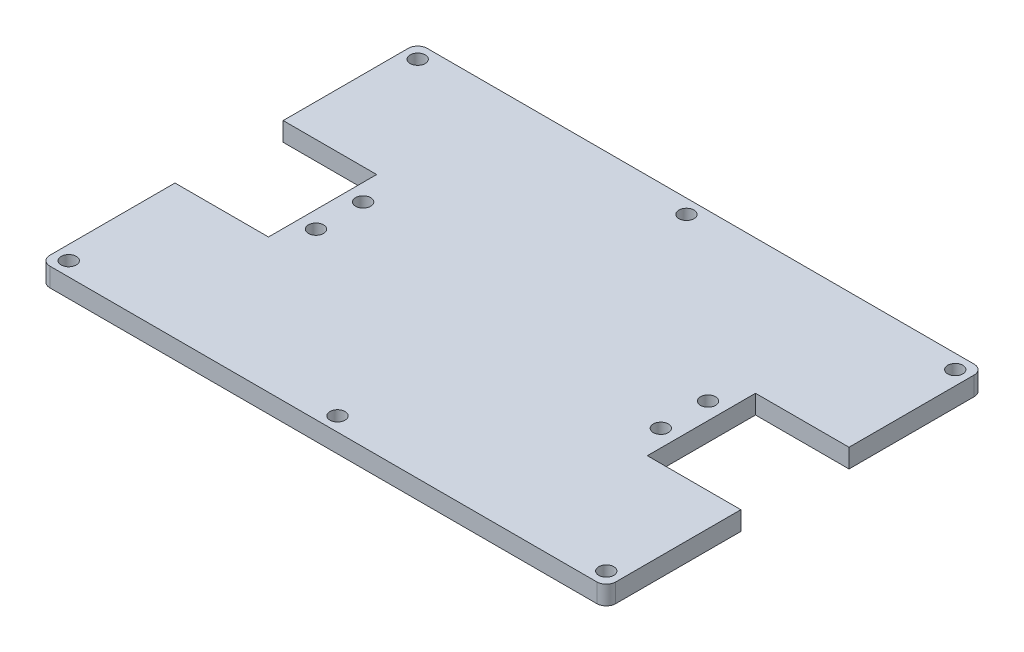
ISO-10303-21;
HEADER;
FILE_DESCRIPTION(('STEP AP214'),'2;1');
FILE_NAME('part.step','',(''),(''),'','','');
FILE_SCHEMA(('AUTOMOTIVE_DESIGN { 1 0 10303 214 1 1 1 1 }'));
ENDSEC;
DATA;
#1=APPLICATION_CONTEXT('core data for automotive mechanical design processes');
#2=APPLICATION_PROTOCOL_DEFINITION('international standard','automotive_design',2000,#1);
#3=PRODUCT_CONTEXT('',#1,'mechanical');
#4=PRODUCT('Part','Part','',(#3));
#5=PRODUCT_RELATED_PRODUCT_CATEGORY('part','',(#4));
#6=PRODUCT_DEFINITION_FORMATION('','',#4);
#7=PRODUCT_DEFINITION_CONTEXT('part definition',#1,'design');
#8=PRODUCT_DEFINITION('design','',#6,#7);
#9=PRODUCT_DEFINITION_SHAPE('','',#8);
#10=(LENGTH_UNIT() NAMED_UNIT(*) SI_UNIT(.MILLI.,.METRE.));
#11=(NAMED_UNIT(*) PLANE_ANGLE_UNIT() SI_UNIT($,.RADIAN.));
#12=(NAMED_UNIT(*) SI_UNIT($,.STERADIAN.) SOLID_ANGLE_UNIT());
#13=UNCERTAINTY_MEASURE_WITH_UNIT(LENGTH_MEASURE(1.E-05),#10,'distance_accuracy_value','');
#14=(GEOMETRIC_REPRESENTATION_CONTEXT(3) GLOBAL_UNCERTAINTY_ASSIGNED_CONTEXT((#13)) GLOBAL_UNIT_ASSIGNED_CONTEXT((#10,
#11,#12)) REPRESENTATION_CONTEXT('',''));
#15=CARTESIAN_POINT('',(0.,0.,0.));
#16=DIRECTION('',(0.,0.,1.));
#17=DIRECTION('',(1.,0.,0.));
#18=AXIS2_PLACEMENT_3D('',#15,#16,#17);
#19=CARTESIAN_POINT('',(100.17,4.,0.));
#20=DIRECTION('',(1.,0.,0.));
#21=DIRECTION('',(0.,0.,-1.));
#22=AXIS2_PLACEMENT_3D('',#19,#20,#21);
#23=PLANE('',#22);
#24=DIRECTION('',(0.,0.,1.));
#25=VECTOR('',#24,1.);
#26=CARTESIAN_POINT('',(100.17,0.,0.));
#27=LINE('',#26,#25);
#28=CARTESIAN_POINT('',(100.17,0.,-51.47));
#29=VERTEX_POINT('',#28);
#30=CARTESIAN_POINT('',(100.17,0.,-28.53));
#31=VERTEX_POINT('',#30);
#32=EDGE_CURVE('E155',#29,#31,#27,.T.);
#33=ORIENTED_EDGE('',*,*,#32,.F.);
#34=DIRECTION('',(0.,-1.,0.));
#35=VECTOR('',#34,1.);
#36=CARTESIAN_POINT('',(100.17,4.,-51.47));
#37=LINE('',#36,#35);
#38=CARTESIAN_POINT('',(100.17,4.,-51.47));
#39=VERTEX_POINT('',#38);
#40=EDGE_CURVE('E151',#39,#29,#37,.T.);
#41=ORIENTED_EDGE('',*,*,#40,.F.);
#42=DIRECTION('',(0.,0.,1.));
#43=VECTOR('',#42,1.);
#44=CARTESIAN_POINT('',(100.17,4.,0.));
#45=LINE('',#44,#43);
#46=CARTESIAN_POINT('',(100.17,4.,-28.53));
#47=VERTEX_POINT('',#46);
#48=EDGE_CURVE('E153',#39,#47,#45,.T.);
#49=ORIENTED_EDGE('',*,*,#48,.T.);
#50=DIRECTION('',(0.,-1.,0.));
#51=VECTOR('',#50,1.);
#52=CARTESIAN_POINT('',(100.17,4.,-28.53));
#53=LINE('',#52,#51);
#54=EDGE_CURVE('E211',#47,#31,#53,.T.);
#55=ORIENTED_EDGE('',*,*,#54,.T.);
#56=EDGE_LOOP('',(#33,#41,#49,#55));
#57=FACE_BOUND('',#56,.T.);
#58=ADVANCED_FACE('F39',(#57),#23,.T.);
#59=CARTESIAN_POINT('',(0.,4.,-51.47));
#60=DIRECTION('',(0.,0.,1.));
#61=DIRECTION('',(1.,0.,0.));
#62=AXIS2_PLACEMENT_3D('',#59,#60,#61);
#63=PLANE('',#62);
#64=DIRECTION('',(-1.,0.,0.));
#65=VECTOR('',#64,1.);
#66=CARTESIAN_POINT('',(0.,0.,-51.47));
#67=LINE('',#66,#65);
#68=CARTESIAN_POINT('',(120.,0.,-51.47));
#69=VERTEX_POINT('',#68);
#70=EDGE_CURVE('E254',#69,#29,#67,.T.);
#71=ORIENTED_EDGE('',*,*,#70,.F.);
#72=DIRECTION('',(0.,-1.,0.));
#73=VECTOR('',#72,1.);
#74=CARTESIAN_POINT('',(120.,4.,-51.47));
#75=LINE('',#74,#73);
#76=CARTESIAN_POINT('',(120.,4.,-51.47));
#77=VERTEX_POINT('',#76);
#78=EDGE_CURVE('E162',#77,#69,#75,.T.);
#79=ORIENTED_EDGE('',*,*,#78,.F.);
#80=DIRECTION('',(-1.,0.,0.));
#81=VECTOR('',#80,1.);
#82=CARTESIAN_POINT('',(0.,4.,-51.47));
#83=LINE('',#82,#81);
#84=EDGE_CURVE('E168',#77,#39,#83,.T.);
#85=ORIENTED_EDGE('',*,*,#84,.T.);
#86=ORIENTED_EDGE('',*,*,#40,.T.);
#87=EDGE_LOOP('',(#71,#79,#85,#86));
#88=FACE_BOUND('',#87,.T.);
#89=ADVANCED_FACE('F175',(#88),#63,.T.);
#90=CARTESIAN_POINT('',(120.,4.,0.));
#91=DIRECTION('',(-1.,0.,0.));
#92=DIRECTION('',(0.,0.,1.));
#93=AXIS2_PLACEMENT_3D('',#90,#91,#92);
#94=PLANE('',#93);
#95=DIRECTION('',(0.,0.,-1.));
#96=VECTOR('',#95,1.);
#97=CARTESIAN_POINT('',(120.,0.,0.));
#98=LINE('',#97,#96);
#99=CARTESIAN_POINT('',(120.,0.,-78.));
#100=VERTEX_POINT('',#99);
#101=EDGE_CURVE('E257',#69,#100,#98,.T.);
#102=ORIENTED_EDGE('',*,*,#101,.T.);
#103=DIRECTION('',(0.,-1.,0.));
#104=VECTOR('',#103,1.);
#105=CARTESIAN_POINT('',(120.,4.,-78.));
#106=LINE('',#105,#104);
#107=CARTESIAN_POINT('',(120.,4.,-78.));
#108=VERTEX_POINT('',#107);
#109=EDGE_CURVE('E333',#100,#108,#106,.F.);
#110=ORIENTED_EDGE('',*,*,#109,.T.);
#111=DIRECTION('',(0.,0.,-1.));
#112=VECTOR('',#111,1.);
#113=CARTESIAN_POINT('',(120.,4.,0.));
#114=LINE('',#113,#112);
#115=EDGE_CURVE('E178',#77,#108,#114,.T.);
#116=ORIENTED_EDGE('',*,*,#115,.F.);
#117=ORIENTED_EDGE('',*,*,#78,.T.);
#118=EDGE_LOOP('',(#102,#110,#116,#117));
#119=FACE_BOUND('',#118,.T.);
#120=ADVANCED_FACE('F435',(#119),#94,.F.);
#121=CARTESIAN_POINT('',(0.,4.,-80.));
#122=DIRECTION('',(0.,0.,-1.));
#123=DIRECTION('',(-1.,0.,0.));
#124=AXIS2_PLACEMENT_3D('',#121,#122,#123);
#125=PLANE('',#124);
#126=DIRECTION('',(1.,0.,0.));
#127=VECTOR('',#126,1.);
#128=CARTESIAN_POINT('',(0.,4.,-80.));
#129=LINE('',#128,#127);
#130=CARTESIAN_POINT('',(2.,4.,-80.));
#131=VERTEX_POINT('',#130);
#132=CARTESIAN_POINT('',(118.,4.,-80.));
#133=VERTEX_POINT('',#132);
#134=EDGE_CURVE('E181',#131,#133,#129,.T.);
#135=ORIENTED_EDGE('',*,*,#134,.T.);
#136=DIRECTION('',(0.,-1.,0.));
#137=VECTOR('',#136,1.);
#138=CARTESIAN_POINT('',(118.,0.,-80.));
#139=LINE('',#138,#137);
#140=CARTESIAN_POINT('',(118.,0.,-80.));
#141=VERTEX_POINT('',#140);
#142=EDGE_CURVE('E326',#133,#141,#139,.T.);
#143=ORIENTED_EDGE('',*,*,#142,.T.);
#144=DIRECTION('',(1.,0.,0.));
#145=VECTOR('',#144,1.);
#146=CARTESIAN_POINT('',(0.,0.,-80.));
#147=LINE('',#146,#145);
#148=CARTESIAN_POINT('',(2.,0.,-80.));
#149=VERTEX_POINT('',#148);
#150=EDGE_CURVE('E261',#149,#141,#147,.T.);
#151=ORIENTED_EDGE('',*,*,#150,.F.);
#152=DIRECTION('',(0.,-1.,0.));
#153=VECTOR('',#152,1.);
#154=CARTESIAN_POINT('',(2.,4.,-80.));
#155=LINE('',#154,#153);
#156=EDGE_CURVE('E320',#149,#131,#155,.F.);
#157=ORIENTED_EDGE('',*,*,#156,.T.);
#158=EDGE_LOOP('',(#135,#143,#151,#157));
#159=FACE_BOUND('',#158,.T.);
#160=ADVANCED_FACE('F507',(#159),#125,.T.);
#161=CARTESIAN_POINT('',(0.,4.,0.));
#162=DIRECTION('',(-1.,0.,0.));
#163=DIRECTION('',(0.,0.,1.));
#164=AXIS2_PLACEMENT_3D('',#161,#162,#163);
#165=PLANE('',#164);
#166=DIRECTION('',(0.,0.,-1.));
#167=VECTOR('',#166,1.);
#168=CARTESIAN_POINT('',(0.,4.,0.));
#169=LINE('',#168,#167);
#170=CARTESIAN_POINT('',(0.,4.,-51.47));
#171=VERTEX_POINT('',#170);
#172=CARTESIAN_POINT('',(0.,4.,-78.));
#173=VERTEX_POINT('',#172);
#174=EDGE_CURVE('E189',#171,#173,#169,.T.);
#175=ORIENTED_EDGE('',*,*,#174,.T.);
#176=DIRECTION('',(0.,-1.,0.));
#177=VECTOR('',#176,1.);
#178=CARTESIAN_POINT('',(0.,4.,-78.));
#179=LINE('',#178,#177);
#180=CARTESIAN_POINT('',(0.,0.,-78.));
#181=VERTEX_POINT('',#180);
#182=EDGE_CURVE('E161',#173,#181,#179,.T.);
#183=ORIENTED_EDGE('',*,*,#182,.T.);
#184=DIRECTION('',(0.,0.,-1.));
#185=VECTOR('',#184,1.);
#186=CARTESIAN_POINT('',(0.,0.,0.));
#187=LINE('',#186,#185);
#188=CARTESIAN_POINT('',(0.,0.,-51.47));
#189=VERTEX_POINT('',#188);
#190=EDGE_CURVE('E266',#189,#181,#187,.T.);
#191=ORIENTED_EDGE('',*,*,#190,.F.);
#192=DIRECTION('',(0.,-1.,0.));
#193=VECTOR('',#192,1.);
#194=CARTESIAN_POINT('',(0.,4.,-51.47));
#195=LINE('',#194,#193);
#196=EDGE_CURVE('E309',#171,#189,#195,.T.);
#197=ORIENTED_EDGE('',*,*,#196,.F.);
#198=EDGE_LOOP('',(#175,#183,#191,#197));
#199=FACE_BOUND('',#198,.T.);
#200=ADVANCED_FACE('F513',(#199),#165,.T.);
#201=CARTESIAN_POINT('',(0.,4.,-51.47));
#202=DIRECTION('',(0.,0.,-1.));
#203=DIRECTION('',(-1.,0.,0.));
#204=AXIS2_PLACEMENT_3D('',#201,#202,#203);
#205=PLANE('',#204);
#206=DIRECTION('',(1.,0.,0.));
#207=VECTOR('',#206,1.);
#208=CARTESIAN_POINT('',(0.,0.,-51.47));
#209=LINE('',#208,#207);
#210=CARTESIAN_POINT('',(19.83,0.,-51.47));
#211=VERTEX_POINT('',#210);
#212=EDGE_CURVE('E270',#189,#211,#209,.T.);
#213=ORIENTED_EDGE('',*,*,#212,.T.);
#214=DIRECTION('',(0.,-1.,0.));
#215=VECTOR('',#214,1.);
#216=CARTESIAN_POINT('',(19.83,4.,-51.47));
#217=LINE('',#216,#215);
#218=CARTESIAN_POINT('',(19.83,4.,-51.47));
#219=VERTEX_POINT('',#218);
#220=EDGE_CURVE('E305',#219,#211,#217,.T.);
#221=ORIENTED_EDGE('',*,*,#220,.F.);
#222=DIRECTION('',(1.,0.,0.));
#223=VECTOR('',#222,1.);
#224=CARTESIAN_POINT('',(0.,4.,-51.47));
#225=LINE('',#224,#223);
#226=EDGE_CURVE('E193',#171,#219,#225,.T.);
#227=ORIENTED_EDGE('',*,*,#226,.F.);
#228=ORIENTED_EDGE('',*,*,#196,.T.);
#229=EDGE_LOOP('',(#213,#221,#227,#228));
#230=FACE_BOUND('',#229,.T.);
#231=ADVANCED_FACE('F518',(#230),#205,.F.);
#232=CARTESIAN_POINT('',(19.83,4.,0.));
#233=DIRECTION('',(1.,0.,0.));
#234=DIRECTION('',(0.,0.,-1.));
#235=AXIS2_PLACEMENT_3D('',#232,#233,#234);
#236=PLANE('',#235);
#237=DIRECTION('',(0.,0.,1.));
#238=VECTOR('',#237,1.);
#239=CARTESIAN_POINT('',(19.83,0.,0.));
#240=LINE('',#239,#238);
#241=CARTESIAN_POINT('',(19.83,0.,-28.53));
#242=VERTEX_POINT('',#241);
#243=EDGE_CURVE('E275',#211,#242,#240,.T.);
#244=ORIENTED_EDGE('',*,*,#243,.T.);
#245=DIRECTION('',(0.,-1.,0.));
#246=VECTOR('',#245,1.);
#247=CARTESIAN_POINT('',(19.83,4.,-28.53));
#248=LINE('',#247,#246);
#249=CARTESIAN_POINT('',(19.83,4.,-28.53));
#250=VERTEX_POINT('',#249);
#251=EDGE_CURVE('E301',#250,#242,#248,.T.);
#252=ORIENTED_EDGE('',*,*,#251,.F.);
#253=DIRECTION('',(0.,0.,1.));
#254=VECTOR('',#253,1.);
#255=CARTESIAN_POINT('',(19.83,4.,0.));
#256=LINE('',#255,#254);
#257=EDGE_CURVE('E198',#219,#250,#256,.T.);
#258=ORIENTED_EDGE('',*,*,#257,.F.);
#259=ORIENTED_EDGE('',*,*,#220,.T.);
#260=EDGE_LOOP('',(#244,#252,#258,#259));
#261=FACE_BOUND('',#260,.T.);
#262=ADVANCED_FACE('F520',(#261),#236,.F.);
#263=CARTESIAN_POINT('',(0.,4.,-28.53));
#264=DIRECTION('',(0.,0.,1.));
#265=DIRECTION('',(1.,0.,0.));
#266=AXIS2_PLACEMENT_3D('',#263,#264,#265);
#267=PLANE('',#266);
#268=DIRECTION('',(-1.,0.,0.));
#269=VECTOR('',#268,1.);
#270=CARTESIAN_POINT('',(0.,0.,-28.53));
#271=LINE('',#270,#269);
#272=CARTESIAN_POINT('',(0.,0.,-28.53));
#273=VERTEX_POINT('',#272);
#274=EDGE_CURVE('E279',#242,#273,#271,.T.);
#275=ORIENTED_EDGE('',*,*,#274,.T.);
#276=DIRECTION('',(0.,-1.,0.));
#277=VECTOR('',#276,1.);
#278=CARTESIAN_POINT('',(0.,4.,-28.53));
#279=LINE('',#278,#277);
#280=CARTESIAN_POINT('',(0.,4.,-28.53));
#281=VERTEX_POINT('',#280);
#282=EDGE_CURVE('E297',#281,#273,#279,.T.);
#283=ORIENTED_EDGE('',*,*,#282,.F.);
#284=DIRECTION('',(-1.,0.,0.));
#285=VECTOR('',#284,1.);
#286=CARTESIAN_POINT('',(0.,4.,-28.53));
#287=LINE('',#286,#285);
#288=EDGE_CURVE('E202',#250,#281,#287,.T.);
#289=ORIENTED_EDGE('',*,*,#288,.F.);
#290=ORIENTED_EDGE('',*,*,#251,.T.);
#291=EDGE_LOOP('',(#275,#283,#289,#290));
#292=FACE_BOUND('',#291,.T.);
#293=ADVANCED_FACE('F367',(#292),#267,.F.);
#294=CARTESIAN_POINT('',(0.,0.,-2.));
#295=VERTEX_POINT('',#294);
#296=EDGE_CURVE('E271',#295,#273,#187,.T.);
#297=ORIENTED_EDGE('',*,*,#296,.F.);
#298=DIRECTION('',(0.,-1.,0.));
#299=VECTOR('',#298,1.);
#300=CARTESIAN_POINT('',(0.,4.,-2.));
#301=LINE('',#300,#299);
#302=CARTESIAN_POINT('',(0.,4.,-2.));
#303=VERTEX_POINT('',#302);
#304=EDGE_CURVE('E48',#295,#303,#301,.F.);
#305=ORIENTED_EDGE('',*,*,#304,.T.);
#306=EDGE_CURVE('E194',#303,#281,#169,.T.);
#307=ORIENTED_EDGE('',*,*,#306,.T.);
#308=ORIENTED_EDGE('',*,*,#282,.T.);
#309=EDGE_LOOP('',(#297,#305,#307,#308));
#310=FACE_BOUND('',#309,.T.);
#311=ADVANCED_FACE('F362',(#310),#165,.T.);
#312=CARTESIAN_POINT('',(0.,4.,0.));
#313=DIRECTION('',(0.,0.,-1.));
#314=DIRECTION('',(-1.,0.,0.));
#315=AXIS2_PLACEMENT_3D('',#312,#313,#314);
#316=PLANE('',#315);
#317=DIRECTION('',(1.,0.,0.));
#318=VECTOR('',#317,1.);
#319=CARTESIAN_POINT('',(0.,4.,0.));
#320=LINE('',#319,#318);
#321=CARTESIAN_POINT('',(2.,4.,0.));
#322=VERTEX_POINT('',#321);
#323=CARTESIAN_POINT('',(118.,4.,0.));
#324=VERTEX_POINT('',#323);
#325=EDGE_CURVE('E206',#322,#324,#320,.T.);
#326=ORIENTED_EDGE('',*,*,#325,.F.);
#327=DIRECTION('',(0.,-1.,0.));
#328=VECTOR('',#327,1.);
#329=CARTESIAN_POINT('',(2.,0.,0.));
#330=LINE('',#329,#328);
#331=CARTESIAN_POINT('',(2.,0.,0.));
#332=VERTEX_POINT('',#331);
#333=EDGE_CURVE('E354',#322,#332,#330,.T.);
#334=ORIENTED_EDGE('',*,*,#333,.T.);
#335=DIRECTION('',(1.,0.,0.));
#336=VECTOR('',#335,1.);
#337=CARTESIAN_POINT('',(0.,0.,0.));
#338=LINE('',#337,#336);
#339=CARTESIAN_POINT('',(118.,0.,0.));
#340=VERTEX_POINT('',#339);
#341=EDGE_CURVE('E283',#332,#340,#338,.T.);
#342=ORIENTED_EDGE('',*,*,#341,.T.);
#343=DIRECTION('',(0.,-1.,0.));
#344=VECTOR('',#343,1.);
#345=CARTESIAN_POINT('',(118.,4.,0.));
#346=LINE('',#345,#344);
#347=EDGE_CURVE('E347',#340,#324,#346,.F.);
#348=ORIENTED_EDGE('',*,*,#347,.T.);
#349=EDGE_LOOP('',(#326,#334,#342,#348));
#350=FACE_BOUND('',#349,.T.);
#351=ADVANCED_FACE('F540',(#350),#316,.F.);
#352=CARTESIAN_POINT('',(120.,4.,-2.));
#353=VERTEX_POINT('',#352);
#354=CARTESIAN_POINT('',(120.,4.,-28.53));
#355=VERTEX_POINT('',#354);
#356=EDGE_CURVE('E183',#353,#355,#114,.T.);
#357=ORIENTED_EDGE('',*,*,#356,.F.);
#358=DIRECTION('',(0.,-1.,0.));
#359=VECTOR('',#358,1.);
#360=CARTESIAN_POINT('',(120.,4.,-2.));
#361=LINE('',#360,#359);
#362=CARTESIAN_POINT('',(120.,0.,-2.));
#363=VERTEX_POINT('',#362);
#364=EDGE_CURVE('E339',#353,#363,#361,.T.);
#365=ORIENTED_EDGE('',*,*,#364,.T.);
#366=CARTESIAN_POINT('',(120.,0.,-28.53));
#367=VERTEX_POINT('',#366);
#368=EDGE_CURVE('E262',#363,#367,#98,.T.);
#369=ORIENTED_EDGE('',*,*,#368,.T.);
#370=DIRECTION('',(0.,-1.,0.));
#371=VECTOR('',#370,1.);
#372=CARTESIAN_POINT('',(120.,4.,-28.53));
#373=LINE('',#372,#371);
#374=EDGE_CURVE('E293',#355,#367,#373,.T.);
#375=ORIENTED_EDGE('',*,*,#374,.F.);
#376=EDGE_LOOP('',(#357,#365,#369,#375));
#377=FACE_BOUND('',#376,.T.);
#378=ADVANCED_FACE('F442',(#377),#94,.F.);
#379=CARTESIAN_POINT('',(3.,4.,-77.));
#380=DIRECTION('',(0.,-1.,0.));
#381=DIRECTION('',(0.,0.,-1.));
#382=AXIS2_PLACEMENT_3D('',#379,#380,#381);
#383=CYLINDRICAL_SURFACE('',#382,1.6);
#384=CARTESIAN_POINT('',(3.,4.,-77.));
#385=DIRECTION('',(0.,1.,0.));
#386=DIRECTION('',(0.,0.,1.));
#387=AXIS2_PLACEMENT_3D('',#384,#385,#386);
#388=CIRCLE('',#387,1.6);
#389=CARTESIAN_POINT('',(3.,4.,-75.4));
#390=VERTEX_POINT('',#389);
#391=EDGE_CURVE('E173',#390,#390,#388,.T.);
#392=ORIENTED_EDGE('',*,*,#391,.T.);
#393=EDGE_LOOP('',(#392));
#394=FACE_BOUND('',#393,.T.);
#395=CARTESIAN_POINT('',(3.,0.,-77.));
#396=DIRECTION('',(0.,1.,0.));
#397=DIRECTION('',(0.,0.,1.));
#398=AXIS2_PLACEMENT_3D('',#395,#396,#397);
#399=CIRCLE('',#398,1.6);
#400=CARTESIAN_POINT('',(3.,0.,-75.4));
#401=VERTEX_POINT('',#400);
#402=EDGE_CURVE('E248',#401,#401,#399,.T.);
#403=ORIENTED_EDGE('',*,*,#402,.F.);
#404=EDGE_LOOP('',(#403));
#405=FACE_BOUND('',#404,.T.);
#406=ADVANCED_FACE('F411',(#394,#405),#383,.F.);
#407=CARTESIAN_POINT('',(3.,4.,-3.));
#408=DIRECTION('',(0.,-1.,0.));
#409=DIRECTION('',(0.,0.,-1.));
#410=AXIS2_PLACEMENT_3D('',#407,#408,#409);
#411=CYLINDRICAL_SURFACE('',#410,1.6);
#412=CARTESIAN_POINT('',(3.,4.,-3.));
#413=DIRECTION('',(0.,1.,0.));
#414=DIRECTION('',(0.,0.,1.));
#415=AXIS2_PLACEMENT_3D('',#412,#413,#414);
#416=CIRCLE('',#415,1.6);
#417=CARTESIAN_POINT('',(3.,4.,-1.4));
#418=VERTEX_POINT('',#417);
#419=EDGE_CURVE('E403',#418,#418,#416,.T.);
#420=ORIENTED_EDGE('',*,*,#419,.T.);
#421=EDGE_LOOP('',(#420));
#422=FACE_BOUND('',#421,.T.);
#423=CARTESIAN_POINT('',(3.,0.,-3.));
#424=DIRECTION('',(0.,1.,0.));
#425=DIRECTION('',(0.,0.,1.));
#426=AXIS2_PLACEMENT_3D('',#423,#424,#425);
#427=CIRCLE('',#426,1.6);
#428=CARTESIAN_POINT('',(3.,0.,-1.4));
#429=VERTEX_POINT('',#428);
#430=EDGE_CURVE('E244',#429,#429,#427,.T.);
#431=ORIENTED_EDGE('',*,*,#430,.F.);
#432=EDGE_LOOP('',(#431));
#433=FACE_BOUND('',#432,.T.);
#434=ADVANCED_FACE('F441',(#422,#433),#411,.F.);
#435=CARTESIAN_POINT('',(117.,4.,-77.));
#436=DIRECTION('',(0.,-1.,0.));
#437=DIRECTION('',(0.,0.,-1.));
#438=AXIS2_PLACEMENT_3D('',#435,#436,#437);
#439=CYLINDRICAL_SURFACE('',#438,1.60000000000001);
#440=CARTESIAN_POINT('',(117.,4.,-77.));
#441=DIRECTION('',(0.,1.,0.));
#442=DIRECTION('',(0.,0.,1.));
#443=AXIS2_PLACEMENT_3D('',#440,#441,#442);
#444=CIRCLE('',#443,1.60000000000001);
#445=CARTESIAN_POINT('',(117.,4.,-75.4));
#446=VERTEX_POINT('',#445);
#447=EDGE_CURVE('E399',#446,#446,#444,.T.);
#448=ORIENTED_EDGE('',*,*,#447,.T.);
#449=EDGE_LOOP('',(#448));
#450=FACE_BOUND('',#449,.T.);
#451=CARTESIAN_POINT('',(117.,0.,-77.));
#452=DIRECTION('',(0.,1.,0.));
#453=DIRECTION('',(0.,0.,1.));
#454=AXIS2_PLACEMENT_3D('',#451,#452,#453);
#455=CIRCLE('',#454,1.60000000000001);
#456=CARTESIAN_POINT('',(117.,0.,-75.4));
#457=VERTEX_POINT('',#456);
#458=EDGE_CURVE('E240',#457,#457,#455,.T.);
#459=ORIENTED_EDGE('',*,*,#458,.F.);
#460=EDGE_LOOP('',(#459));
#461=FACE_BOUND('',#460,.T.);
#462=ADVANCED_FACE('F445',(#450,#461),#439,.F.);
#463=CARTESIAN_POINT('',(117.,4.,-3.));
#464=DIRECTION('',(0.,-1.,0.));
#465=DIRECTION('',(0.,0.,-1.));
#466=AXIS2_PLACEMENT_3D('',#463,#464,#465);
#467=CYLINDRICAL_SURFACE('',#466,1.60000000000001);
#468=CARTESIAN_POINT('',(117.,4.,-3.));
#469=DIRECTION('',(0.,1.,0.));
#470=DIRECTION('',(0.,0.,1.));
#471=AXIS2_PLACEMENT_3D('',#468,#469,#470);
#472=CIRCLE('',#471,1.60000000000001);
#473=CARTESIAN_POINT('',(117.,4.,-1.39999999999999));
#474=VERTEX_POINT('',#473);
#475=EDGE_CURVE('E395',#474,#474,#472,.T.);
#476=ORIENTED_EDGE('',*,*,#475,.T.);
#477=EDGE_LOOP('',(#476));
#478=FACE_BOUND('',#477,.T.);
#479=CARTESIAN_POINT('',(117.,0.,-3.));
#480=DIRECTION('',(0.,1.,0.));
#481=DIRECTION('',(0.,0.,1.));
#482=AXIS2_PLACEMENT_3D('',#479,#480,#481);
#483=CIRCLE('',#482,1.60000000000001);
#484=CARTESIAN_POINT('',(117.,0.,-1.39999999999999));
#485=VERTEX_POINT('',#484);
#486=EDGE_CURVE('E236',#485,#485,#483,.T.);
#487=ORIENTED_EDGE('',*,*,#486,.F.);
#488=EDGE_LOOP('',(#487));
#489=FACE_BOUND('',#488,.T.);
#490=ADVANCED_FACE('F449',(#478,#489),#467,.F.);
#491=CARTESIAN_POINT('',(23.43,4.,-45.));
#492=DIRECTION('',(0.,-1.,0.));
#493=DIRECTION('',(0.,0.,-1.));
#494=AXIS2_PLACEMENT_3D('',#491,#492,#493);
#495=CYLINDRICAL_SURFACE('',#494,1.6);
#496=CARTESIAN_POINT('',(23.43,4.,-45.));
#497=DIRECTION('',(0.,1.,0.));
#498=DIRECTION('',(0.,0.,1.));
#499=AXIS2_PLACEMENT_3D('',#496,#497,#498);
#500=CIRCLE('',#499,1.6);
#501=CARTESIAN_POINT('',(23.43,4.,-43.4));
#502=VERTEX_POINT('',#501);
#503=EDGE_CURVE('E391',#502,#502,#500,.T.);
#504=ORIENTED_EDGE('',*,*,#503,.T.);
#505=EDGE_LOOP('',(#504));
#506=FACE_BOUND('',#505,.T.);
#507=CARTESIAN_POINT('',(23.43,0.,-45.));
#508=DIRECTION('',(0.,1.,0.));
#509=DIRECTION('',(0.,0.,1.));
#510=AXIS2_PLACEMENT_3D('',#507,#508,#509);
#511=CIRCLE('',#510,1.6);
#512=CARTESIAN_POINT('',(23.43,0.,-43.4));
#513=VERTEX_POINT('',#512);
#514=EDGE_CURVE('E232',#513,#513,#511,.T.);
#515=ORIENTED_EDGE('',*,*,#514,.F.);
#516=EDGE_LOOP('',(#515));
#517=FACE_BOUND('',#516,.T.);
#518=ADVANCED_FACE('F453',(#506,#517),#495,.F.);
#519=CARTESIAN_POINT('',(23.43,4.,-35.));
#520=DIRECTION('',(0.,-1.,0.));
#521=DIRECTION('',(0.,0.,-1.));
#522=AXIS2_PLACEMENT_3D('',#519,#520,#521);
#523=CYLINDRICAL_SURFACE('',#522,1.6);
#524=CARTESIAN_POINT('',(23.43,4.,-35.));
#525=DIRECTION('',(0.,1.,0.));
#526=DIRECTION('',(0.,0.,1.));
#527=AXIS2_PLACEMENT_3D('',#524,#525,#526);
#528=CIRCLE('',#527,1.6);
#529=CARTESIAN_POINT('',(23.43,4.,-33.4));
#530=VERTEX_POINT('',#529);
#531=EDGE_CURVE('E387',#530,#530,#528,.T.);
#532=ORIENTED_EDGE('',*,*,#531,.T.);
#533=EDGE_LOOP('',(#532));
#534=FACE_BOUND('',#533,.T.);
#535=CARTESIAN_POINT('',(23.43,0.,-35.));
#536=DIRECTION('',(0.,1.,0.));
#537=DIRECTION('',(0.,0.,1.));
#538=AXIS2_PLACEMENT_3D('',#535,#536,#537);
#539=CIRCLE('',#538,1.6);
#540=CARTESIAN_POINT('',(23.43,0.,-33.4));
#541=VERTEX_POINT('',#540);
#542=EDGE_CURVE('E228',#541,#541,#539,.T.);
#543=ORIENTED_EDGE('',*,*,#542,.F.);
#544=EDGE_LOOP('',(#543));
#545=FACE_BOUND('',#544,.T.);
#546=ADVANCED_FACE('F457',(#534,#545),#523,.F.);
#547=CARTESIAN_POINT('',(96.57,4.,-45.));
#548=DIRECTION('',(0.,-1.,0.));
#549=DIRECTION('',(0.,0.,-1.));
#550=AXIS2_PLACEMENT_3D('',#547,#548,#549);
#551=CYLINDRICAL_SURFACE('',#550,1.60000000000001);
#552=CARTESIAN_POINT('',(96.57,4.,-45.));
#553=DIRECTION('',(0.,1.,0.));
#554=DIRECTION('',(0.,0.,1.));
#555=AXIS2_PLACEMENT_3D('',#552,#553,#554);
#556=CIRCLE('',#555,1.60000000000001);
#557=CARTESIAN_POINT('',(96.57,4.,-43.4));
#558=VERTEX_POINT('',#557);
#559=EDGE_CURVE('E383',#558,#558,#556,.T.);
#560=ORIENTED_EDGE('',*,*,#559,.T.);
#561=EDGE_LOOP('',(#560));
#562=FACE_BOUND('',#561,.T.);
#563=CARTESIAN_POINT('',(96.57,0.,-45.));
#564=DIRECTION('',(0.,1.,0.));
#565=DIRECTION('',(0.,0.,1.));
#566=AXIS2_PLACEMENT_3D('',#563,#564,#565);
#567=CIRCLE('',#566,1.60000000000001);
#568=CARTESIAN_POINT('',(96.57,0.,-43.4));
#569=VERTEX_POINT('',#568);
#570=EDGE_CURVE('E224',#569,#569,#567,.T.);
#571=ORIENTED_EDGE('',*,*,#570,.F.);
#572=EDGE_LOOP('',(#571));
#573=FACE_BOUND('',#572,.T.);
#574=ADVANCED_FACE('F461',(#562,#573),#551,.F.);
#575=CARTESIAN_POINT('',(96.57,4.,-35.));
#576=DIRECTION('',(0.,-1.,0.));
#577=DIRECTION('',(0.,0.,-1.));
#578=AXIS2_PLACEMENT_3D('',#575,#576,#577);
#579=CYLINDRICAL_SURFACE('',#578,1.60000000000001);
#580=CARTESIAN_POINT('',(96.57,4.,-35.));
#581=DIRECTION('',(0.,1.,0.));
#582=DIRECTION('',(0.,0.,1.));
#583=AXIS2_PLACEMENT_3D('',#580,#581,#582);
#584=CIRCLE('',#583,1.60000000000001);
#585=CARTESIAN_POINT('',(96.57,4.,-33.4));
#586=VERTEX_POINT('',#585);
#587=EDGE_CURVE('E379',#586,#586,#584,.T.);
#588=ORIENTED_EDGE('',*,*,#587,.T.);
#589=EDGE_LOOP('',(#588));
#590=FACE_BOUND('',#589,.T.);
#591=CARTESIAN_POINT('',(96.57,0.,-35.));
#592=DIRECTION('',(0.,1.,0.));
#593=DIRECTION('',(0.,0.,1.));
#594=AXIS2_PLACEMENT_3D('',#591,#592,#593);
#595=CIRCLE('',#594,1.60000000000001);
#596=CARTESIAN_POINT('',(96.57,0.,-33.4));
#597=VERTEX_POINT('',#596);
#598=EDGE_CURVE('E220',#597,#597,#595,.T.);
#599=ORIENTED_EDGE('',*,*,#598,.F.);
#600=EDGE_LOOP('',(#599));
#601=FACE_BOUND('',#600,.T.);
#602=ADVANCED_FACE('F465',(#590,#601),#579,.F.);
#603=CARTESIAN_POINT('',(60.,4.,-77.));
#604=DIRECTION('',(0.,-1.,0.));
#605=DIRECTION('',(0.,0.,-1.));
#606=AXIS2_PLACEMENT_3D('',#603,#604,#605);
#607=CYLINDRICAL_SURFACE('',#606,1.6);
#608=CARTESIAN_POINT('',(60.,4.,-77.));
#609=DIRECTION('',(0.,1.,0.));
#610=DIRECTION('',(0.,0.,1.));
#611=AXIS2_PLACEMENT_3D('',#608,#609,#610);
#612=CIRCLE('',#611,1.6);
#613=CARTESIAN_POINT('',(60.,4.,-75.4));
#614=VERTEX_POINT('',#613);
#615=EDGE_CURVE('E375',#614,#614,#612,.T.);
#616=ORIENTED_EDGE('',*,*,#615,.T.);
#617=EDGE_LOOP('',(#616));
#618=FACE_BOUND('',#617,.T.);
#619=CARTESIAN_POINT('',(60.,0.,-77.));
#620=DIRECTION('',(0.,1.,0.));
#621=DIRECTION('',(0.,0.,1.));
#622=AXIS2_PLACEMENT_3D('',#619,#620,#621);
#623=CIRCLE('',#622,1.6);
#624=CARTESIAN_POINT('',(60.,0.,-75.4));
#625=VERTEX_POINT('',#624);
#626=EDGE_CURVE('E216',#625,#625,#623,.T.);
#627=ORIENTED_EDGE('',*,*,#626,.F.);
#628=EDGE_LOOP('',(#627));
#629=FACE_BOUND('',#628,.T.);
#630=ADVANCED_FACE('F469',(#618,#629),#607,.F.);
#631=CARTESIAN_POINT('',(60.,4.,-3.));
#632=DIRECTION('',(0.,-1.,0.));
#633=DIRECTION('',(0.,0.,-1.));
#634=AXIS2_PLACEMENT_3D('',#631,#632,#633);
#635=CYLINDRICAL_SURFACE('',#634,1.6);
#636=CARTESIAN_POINT('',(60.,4.,-3.));
#637=DIRECTION('',(0.,1.,0.));
#638=DIRECTION('',(0.,0.,1.));
#639=AXIS2_PLACEMENT_3D('',#636,#637,#638);
#640=CIRCLE('',#639,1.6);
#641=CARTESIAN_POINT('',(60.,4.,-1.4));
#642=VERTEX_POINT('',#641);
#643=EDGE_CURVE('E290',#642,#642,#640,.T.);
#644=ORIENTED_EDGE('',*,*,#643,.T.);
#645=EDGE_LOOP('',(#644));
#646=FACE_BOUND('',#645,.T.);
#647=CARTESIAN_POINT('',(60.,0.,-3.));
#648=DIRECTION('',(0.,1.,0.));
#649=DIRECTION('',(0.,0.,1.));
#650=AXIS2_PLACEMENT_3D('',#647,#648,#649);
#651=CIRCLE('',#650,1.6);
#652=CARTESIAN_POINT('',(60.,0.,-1.4));
#653=VERTEX_POINT('',#652);
#654=EDGE_CURVE('E212',#653,#653,#651,.T.);
#655=ORIENTED_EDGE('',*,*,#654,.F.);
#656=EDGE_LOOP('',(#655));
#657=FACE_BOUND('',#656,.T.);
#658=ADVANCED_FACE('F425',(#646,#657),#635,.F.);
#659=CARTESIAN_POINT('',(0.,4.,-28.53));
#660=DIRECTION('',(0.,0.,1.));
#661=DIRECTION('',(1.,0.,0.));
#662=AXIS2_PLACEMENT_3D('',#659,#660,#661);
#663=PLANE('',#662);
#664=DIRECTION('',(-1.,0.,0.));
#665=VECTOR('',#664,1.);
#666=CARTESIAN_POINT('',(0.,0.,-28.53));
#667=LINE('',#666,#665);
#668=EDGE_CURVE('E286',#367,#31,#667,.T.);
#669=ORIENTED_EDGE('',*,*,#668,.T.);
#670=ORIENTED_EDGE('',*,*,#54,.F.);
#671=DIRECTION('',(-1.,0.,0.));
#672=VECTOR('',#671,1.);
#673=CARTESIAN_POINT('',(0.,4.,-28.53));
#674=LINE('',#673,#672);
#675=EDGE_CURVE('E170',#355,#47,#674,.T.);
#676=ORIENTED_EDGE('',*,*,#675,.F.);
#677=ORIENTED_EDGE('',*,*,#374,.T.);
#678=EDGE_LOOP('',(#669,#670,#676,#677));
#679=FACE_BOUND('',#678,.T.);
#680=ADVANCED_FACE('F415',(#679),#663,.F.);
#681=CARTESIAN_POINT('',(0.,4.,0.));
#682=DIRECTION('',(0.,1.,0.));
#683=DIRECTION('',(0.,0.,1.));
#684=AXIS2_PLACEMENT_3D('',#681,#682,#683);
#685=PLANE('',#684);
#686=ORIENTED_EDGE('',*,*,#643,.F.);
#687=EDGE_LOOP('',(#686));
#688=FACE_BOUND('',#687,.T.);
#689=ORIENTED_EDGE('',*,*,#615,.F.);
#690=EDGE_LOOP('',(#689));
#691=FACE_BOUND('',#690,.T.);
#692=ORIENTED_EDGE('',*,*,#587,.F.);
#693=EDGE_LOOP('',(#692));
#694=FACE_BOUND('',#693,.T.);
#695=ORIENTED_EDGE('',*,*,#559,.F.);
#696=EDGE_LOOP('',(#695));
#697=FACE_BOUND('',#696,.T.);
#698=ORIENTED_EDGE('',*,*,#531,.F.);
#699=EDGE_LOOP('',(#698));
#700=FACE_BOUND('',#699,.T.);
#701=ORIENTED_EDGE('',*,*,#503,.F.);
#702=EDGE_LOOP('',(#701));
#703=FACE_BOUND('',#702,.T.);
#704=ORIENTED_EDGE('',*,*,#475,.F.);
#705=EDGE_LOOP('',(#704));
#706=FACE_BOUND('',#705,.T.);
#707=ORIENTED_EDGE('',*,*,#447,.F.);
#708=EDGE_LOOP('',(#707));
#709=FACE_BOUND('',#708,.T.);
#710=ORIENTED_EDGE('',*,*,#419,.F.);
#711=EDGE_LOOP('',(#710));
#712=FACE_BOUND('',#711,.T.);
#713=ORIENTED_EDGE('',*,*,#391,.F.);
#714=EDGE_LOOP('',(#713));
#715=FACE_BOUND('',#714,.T.);
#716=ORIENTED_EDGE('',*,*,#306,.F.);
#717=CARTESIAN_POINT('',(2.,4.,-2.));
#718=DIRECTION('',(0.,1.,0.));
#719=DIRECTION('',(0.,0.,1.));
#720=AXIS2_PLACEMENT_3D('',#717,#718,#719);
#721=CIRCLE('',#720,2.);
#722=EDGE_CURVE('E11',#303,#322,#721,.T.);
#723=ORIENTED_EDGE('',*,*,#722,.T.);
#724=ORIENTED_EDGE('',*,*,#325,.T.);
#725=CARTESIAN_POINT('',(118.,4.,-2.));
#726=DIRECTION('',(0.,1.,0.));
#727=DIRECTION('',(0.,0.,1.));
#728=AXIS2_PLACEMENT_3D('',#725,#726,#727);
#729=CIRCLE('',#728,2.);
#730=EDGE_CURVE('E351',#324,#353,#729,.T.);
#731=ORIENTED_EDGE('',*,*,#730,.T.);
#732=ORIENTED_EDGE('',*,*,#356,.T.);
#733=ORIENTED_EDGE('',*,*,#675,.T.);
#734=ORIENTED_EDGE('',*,*,#48,.F.);
#735=ORIENTED_EDGE('',*,*,#84,.F.);
#736=ORIENTED_EDGE('',*,*,#115,.T.);
#737=CARTESIAN_POINT('',(118.,4.,-78.));
#738=DIRECTION('',(0.,1.,0.));
#739=DIRECTION('',(0.,0.,1.));
#740=AXIS2_PLACEMENT_3D('',#737,#738,#739);
#741=CIRCLE('',#740,2.);
#742=EDGE_CURVE('E336',#108,#133,#741,.T.);
#743=ORIENTED_EDGE('',*,*,#742,.T.);
#744=ORIENTED_EDGE('',*,*,#134,.F.);
#745=CARTESIAN_POINT('',(2.,4.,-78.));
#746=DIRECTION('',(0.,1.,0.));
#747=DIRECTION('',(0.,0.,1.));
#748=AXIS2_PLACEMENT_3D('',#745,#746,#747);
#749=CIRCLE('',#748,2.);
#750=EDGE_CURVE('E323',#131,#173,#749,.T.);
#751=ORIENTED_EDGE('',*,*,#750,.T.);
#752=ORIENTED_EDGE('',*,*,#174,.F.);
#753=ORIENTED_EDGE('',*,*,#226,.T.);
#754=ORIENTED_EDGE('',*,*,#257,.T.);
#755=ORIENTED_EDGE('',*,*,#288,.T.);
#756=EDGE_LOOP('',(#716,#723,#724,#731,#732,#733,#734,#735,#736,#743,#744,#751,#752,#753,#754,#755));
#757=FACE_BOUND('',#756,.T.);
#758=ADVANCED_FACE('F166',(#688,#691,#694,#697,#700,#703,#706,#709,#712,#715,#757),#685,.T.);
#759=CARTESIAN_POINT('',(0.,0.,0.));
#760=DIRECTION('',(0.,1.,0.));
#761=DIRECTION('',(0.,0.,1.));
#762=AXIS2_PLACEMENT_3D('',#759,#760,#761);
#763=PLANE('',#762);
#764=ORIENTED_EDGE('',*,*,#654,.T.);
#765=EDGE_LOOP('',(#764));
#766=FACE_BOUND('',#765,.T.);
#767=ORIENTED_EDGE('',*,*,#626,.T.);
#768=EDGE_LOOP('',(#767));
#769=FACE_BOUND('',#768,.T.);
#770=ORIENTED_EDGE('',*,*,#598,.T.);
#771=EDGE_LOOP('',(#770));
#772=FACE_BOUND('',#771,.T.);
#773=ORIENTED_EDGE('',*,*,#570,.T.);
#774=EDGE_LOOP('',(#773));
#775=FACE_BOUND('',#774,.T.);
#776=ORIENTED_EDGE('',*,*,#542,.T.);
#777=EDGE_LOOP('',(#776));
#778=FACE_BOUND('',#777,.T.);
#779=ORIENTED_EDGE('',*,*,#514,.T.);
#780=EDGE_LOOP('',(#779));
#781=FACE_BOUND('',#780,.T.);
#782=ORIENTED_EDGE('',*,*,#486,.T.);
#783=EDGE_LOOP('',(#782));
#784=FACE_BOUND('',#783,.T.);
#785=ORIENTED_EDGE('',*,*,#458,.T.);
#786=EDGE_LOOP('',(#785));
#787=FACE_BOUND('',#786,.T.);
#788=ORIENTED_EDGE('',*,*,#430,.T.);
#789=EDGE_LOOP('',(#788));
#790=FACE_BOUND('',#789,.T.);
#791=ORIENTED_EDGE('',*,*,#402,.T.);
#792=EDGE_LOOP('',(#791));
#793=FACE_BOUND('',#792,.T.);
#794=ORIENTED_EDGE('',*,*,#341,.F.);
#795=CARTESIAN_POINT('',(2.,0.,-2.));
#796=DIRECTION('',(0.,1.,0.));
#797=DIRECTION('',(0.,0.,1.));
#798=AXIS2_PLACEMENT_3D('',#795,#796,#797);
#799=CIRCLE('',#798,2.);
#800=EDGE_CURVE('E62',#332,#295,#799,.F.);
#801=ORIENTED_EDGE('',*,*,#800,.T.);
#802=ORIENTED_EDGE('',*,*,#296,.T.);
#803=ORIENTED_EDGE('',*,*,#274,.F.);
#804=ORIENTED_EDGE('',*,*,#243,.F.);
#805=ORIENTED_EDGE('',*,*,#212,.F.);
#806=ORIENTED_EDGE('',*,*,#190,.T.);
#807=CARTESIAN_POINT('',(2.,0.,-78.));
#808=DIRECTION('',(0.,1.,0.));
#809=DIRECTION('',(0.,0.,1.));
#810=AXIS2_PLACEMENT_3D('',#807,#808,#809);
#811=CIRCLE('',#810,2.);
#812=EDGE_CURVE('E317',#181,#149,#811,.F.);
#813=ORIENTED_EDGE('',*,*,#812,.T.);
#814=ORIENTED_EDGE('',*,*,#150,.T.);
#815=CARTESIAN_POINT('',(118.,0.,-78.));
#816=DIRECTION('',(0.,1.,0.));
#817=DIRECTION('',(0.,0.,1.));
#818=AXIS2_PLACEMENT_3D('',#815,#816,#817);
#819=CIRCLE('',#818,2.);
#820=EDGE_CURVE('E330',#141,#100,#819,.F.);
#821=ORIENTED_EDGE('',*,*,#820,.T.);
#822=ORIENTED_EDGE('',*,*,#101,.F.);
#823=ORIENTED_EDGE('',*,*,#70,.T.);
#824=ORIENTED_EDGE('',*,*,#32,.T.);
#825=ORIENTED_EDGE('',*,*,#668,.F.);
#826=ORIENTED_EDGE('',*,*,#368,.F.);
#827=CARTESIAN_POINT('',(118.,0.,-2.));
#828=DIRECTION('',(0.,1.,0.));
#829=DIRECTION('',(0.,0.,1.));
#830=AXIS2_PLACEMENT_3D('',#827,#828,#829);
#831=CIRCLE('',#830,2.);
#832=EDGE_CURVE('E343',#363,#340,#831,.F.);
#833=ORIENTED_EDGE('',*,*,#832,.T.);
#834=EDGE_LOOP('',(#794,#801,#802,#803,#804,#805,#806,#813,#814,#821,#822,#823,#824,#825,#826,#833));
#835=FACE_BOUND('',#834,.T.);
#836=ADVANCED_FACE('F368',(#766,#769,#772,#775,#778,#781,#784,#787,#790,#793,#835),#763,.F.);
#837=CARTESIAN_POINT('',(2.,4.,-78.));
#838=DIRECTION('',(0.,-1.,0.));
#839=DIRECTION('',(0.,0.,-1.));
#840=AXIS2_PLACEMENT_3D('',#837,#838,#839);
#841=CYLINDRICAL_SURFACE('',#840,2.);
#842=ORIENTED_EDGE('',*,*,#750,.F.);
#843=ORIENTED_EDGE('',*,*,#156,.F.);
#844=ORIENTED_EDGE('',*,*,#812,.F.);
#845=ORIENTED_EDGE('',*,*,#182,.F.);
#846=EDGE_LOOP('',(#842,#843,#844,#845));
#847=FACE_BOUND('',#846,.T.);
#848=ADVANCED_FACE('F422',(#847),#841,.T.);
#849=CARTESIAN_POINT('',(118.,4.,-78.));
#850=DIRECTION('',(0.,1.,0.));
#851=DIRECTION('',(0.,0.,1.));
#852=AXIS2_PLACEMENT_3D('',#849,#850,#851);
#853=CYLINDRICAL_SURFACE('',#852,2.);
#854=ORIENTED_EDGE('',*,*,#742,.F.);
#855=ORIENTED_EDGE('',*,*,#109,.F.);
#856=ORIENTED_EDGE('',*,*,#820,.F.);
#857=ORIENTED_EDGE('',*,*,#142,.F.);
#858=EDGE_LOOP('',(#854,#855,#856,#857));
#859=FACE_BOUND('',#858,.T.);
#860=ADVANCED_FACE('F479',(#859),#853,.T.);
#861=CARTESIAN_POINT('',(118.,4.,-2.));
#862=DIRECTION('',(0.,-1.,0.));
#863=DIRECTION('',(0.,0.,-1.));
#864=AXIS2_PLACEMENT_3D('',#861,#862,#863);
#865=CYLINDRICAL_SURFACE('',#864,2.);
#866=ORIENTED_EDGE('',*,*,#730,.F.);
#867=ORIENTED_EDGE('',*,*,#347,.F.);
#868=ORIENTED_EDGE('',*,*,#832,.F.);
#869=ORIENTED_EDGE('',*,*,#364,.F.);
#870=EDGE_LOOP('',(#866,#867,#868,#869));
#871=FACE_BOUND('',#870,.T.);
#872=ADVANCED_FACE('F482',(#871),#865,.T.);
#873=CARTESIAN_POINT('',(2.,4.,-2.));
#874=DIRECTION('',(0.,1.,0.));
#875=DIRECTION('',(0.,0.,1.));
#876=AXIS2_PLACEMENT_3D('',#873,#874,#875);
#877=CYLINDRICAL_SURFACE('',#876,2.);
#878=ORIENTED_EDGE('',*,*,#722,.F.);
#879=ORIENTED_EDGE('',*,*,#304,.F.);
#880=ORIENTED_EDGE('',*,*,#800,.F.);
#881=ORIENTED_EDGE('',*,*,#333,.F.);
#882=EDGE_LOOP('',(#878,#879,#880,#881));
#883=FACE_BOUND('',#882,.T.);
#884=ADVANCED_FACE('F41',(#883),#877,.T.);
#885=CLOSED_SHELL('',(#58,#89,#120,#160,#200,#231,#262,#293,#311,#351,#378,#406,#434,#462,#490,
#518,#546,#574,#602,#630,#658,#680,#758,#836,#848,#860,#872,#884));
#886=MANIFOLD_SOLID_BREP('B2',#885);
#887=ADVANCED_BREP_SHAPE_REPRESENTATION('',(#18,#886),#14);
#888=SHAPE_DEFINITION_REPRESENTATION(#9,#887);
ENDSEC;
END-ISO-10303-21;
